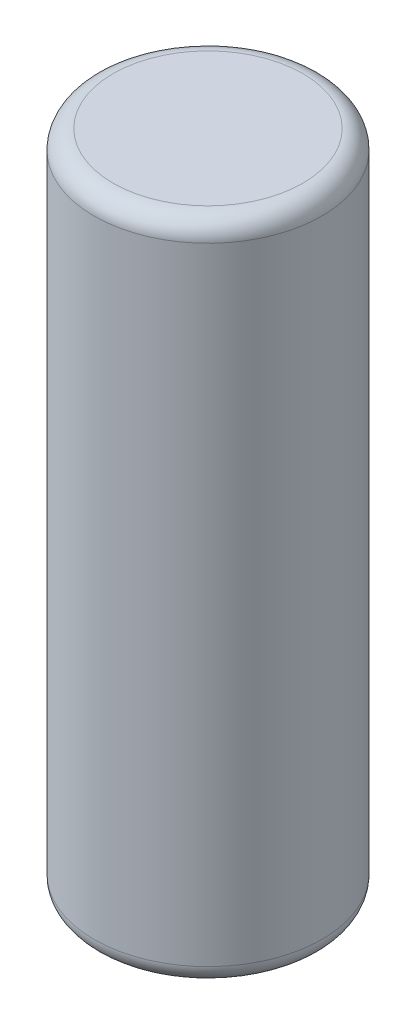
ISO-10303-21;
HEADER;
FILE_DESCRIPTION(('STEP AP214'),'2;1');
FILE_NAME('part.step','',(''),(''),'','','');
FILE_SCHEMA(('AUTOMOTIVE_DESIGN { 1 0 10303 214 1 1 1 1 }'));
ENDSEC;
DATA;
#1=APPLICATION_CONTEXT('core data for automotive mechanical design processes');
#2=APPLICATION_PROTOCOL_DEFINITION('international standard','automotive_design',2000,#1);
#3=PRODUCT_CONTEXT('',#1,'mechanical');
#4=PRODUCT('Part','Part','',(#3));
#5=PRODUCT_RELATED_PRODUCT_CATEGORY('part','',(#4));
#6=PRODUCT_DEFINITION_FORMATION('','',#4);
#7=PRODUCT_DEFINITION_CONTEXT('part definition',#1,'design');
#8=PRODUCT_DEFINITION('design','',#6,#7);
#9=PRODUCT_DEFINITION_SHAPE('','',#8);
#10=(LENGTH_UNIT() NAMED_UNIT(*) SI_UNIT(.MILLI.,.METRE.));
#11=(NAMED_UNIT(*) PLANE_ANGLE_UNIT() SI_UNIT($,.RADIAN.));
#12=(NAMED_UNIT(*) SI_UNIT($,.STERADIAN.) SOLID_ANGLE_UNIT());
#13=UNCERTAINTY_MEASURE_WITH_UNIT(LENGTH_MEASURE(1.E-05),#10,'distance_accuracy_value','');
#14=(GEOMETRIC_REPRESENTATION_CONTEXT(3) GLOBAL_UNCERTAINTY_ASSIGNED_CONTEXT((#13)) GLOBAL_UNIT_ASSIGNED_CONTEXT((#10,
#11,#12)) REPRESENTATION_CONTEXT('',''));
#15=CARTESIAN_POINT('',(0.,0.,0.));
#16=DIRECTION('',(0.,0.,1.));
#17=DIRECTION('',(1.,0.,0.));
#18=AXIS2_PLACEMENT_3D('',#15,#16,#17);
#19=CARTESIAN_POINT('',(0.,35.,0.));
#20=DIRECTION('',(0.,-1.,0.));
#21=DIRECTION('',(0.,0.,-1.));
#22=AXIS2_PLACEMENT_3D('',#19,#20,#21);
#23=CYLINDRICAL_SURFACE('',#22,6.);
#24=CARTESIAN_POINT('',(0.,1.,0.));
#25=DIRECTION('',(0.,1.,0.));
#26=DIRECTION('',(0.,0.,1.));
#27=AXIS2_PLACEMENT_3D('',#24,#25,#26);
#28=CIRCLE('',#27,6.);
#29=CARTESIAN_POINT('',(0.,1.,6.));
#30=VERTEX_POINT('',#29);
#31=EDGE_CURVE('E41',#30,#30,#28,.T.);
#32=ORIENTED_EDGE('',*,*,#31,.T.);
#33=EDGE_LOOP('',(#32));
#34=FACE_BOUND('',#33,.T.);
#35=CARTESIAN_POINT('',(0.,34.,0.));
#36=DIRECTION('',(0.,1.,0.));
#37=DIRECTION('',(0.,0.,1.));
#38=AXIS2_PLACEMENT_3D('',#35,#36,#37);
#39=CIRCLE('',#38,6.);
#40=CARTESIAN_POINT('',(0.,34.,6.));
#41=VERTEX_POINT('',#40);
#42=EDGE_CURVE('E45',#41,#41,#39,.F.);
#43=ORIENTED_EDGE('',*,*,#42,.T.);
#44=EDGE_LOOP('',(#43));
#45=FACE_BOUND('',#44,.T.);
#46=ADVANCED_FACE('F30',(#34,#45),#23,.T.);
#47=CARTESIAN_POINT('',(0.,35.,0.));
#48=DIRECTION('',(0.,1.,0.));
#49=DIRECTION('',(0.,0.,1.));
#50=AXIS2_PLACEMENT_3D('',#47,#48,#49);
#51=PLANE('',#50);
#52=CARTESIAN_POINT('',(0.,35.,0.));
#53=DIRECTION('',(0.,1.,0.));
#54=DIRECTION('',(0.,0.,1.));
#55=AXIS2_PLACEMENT_3D('',#52,#53,#54);
#56=CIRCLE('',#55,5.);
#57=CARTESIAN_POINT('',(0.,35.,5.));
#58=VERTEX_POINT('',#57);
#59=EDGE_CURVE('E10',#58,#58,#56,.T.);
#60=ORIENTED_EDGE('',*,*,#59,.T.);
#61=EDGE_LOOP('',(#60));
#62=FACE_BOUND('',#61,.T.);
#63=ADVANCED_FACE('F61',(#62),#51,.T.);
#64=CARTESIAN_POINT('',(0.,0.,0.));
#65=DIRECTION('',(0.,1.,0.));
#66=DIRECTION('',(0.,0.,1.));
#67=AXIS2_PLACEMENT_3D('',#64,#65,#66);
#68=PLANE('',#67);
#69=CARTESIAN_POINT('',(0.,0.,0.));
#70=DIRECTION('',(0.,1.,0.));
#71=DIRECTION('',(0.,0.,1.));
#72=AXIS2_PLACEMENT_3D('',#69,#70,#71);
#73=CIRCLE('',#72,5.);
#74=CARTESIAN_POINT('',(0.,0.,5.));
#75=VERTEX_POINT('',#74);
#76=EDGE_CURVE('E37',#75,#75,#73,.F.);
#77=ORIENTED_EDGE('',*,*,#76,.T.);
#78=EDGE_LOOP('',(#77));
#79=FACE_BOUND('',#78,.T.);
#80=ADVANCED_FACE('F58',(#79),#68,.F.);
#81=CARTESIAN_POINT('',(0.,1.,0.));
#82=DIRECTION('',(0.,1.,0.));
#83=DIRECTION('',(0.,0.,1.));
#84=AXIS2_PLACEMENT_3D('',#81,#82,#83);
#85=TOROIDAL_SURFACE('',#84,5.,1.);
#86=ORIENTED_EDGE('',*,*,#76,.F.);
#87=EDGE_LOOP('',(#86));
#88=FACE_BOUND('',#87,.T.);
#89=ORIENTED_EDGE('',*,*,#31,.F.);
#90=EDGE_LOOP('',(#89));
#91=FACE_BOUND('',#90,.T.);
#92=ADVANCED_FACE('F54',(#88,#91),#85,.T.);
#93=CARTESIAN_POINT('',(0.,34.,0.));
#94=DIRECTION('',(0.,1.,0.));
#95=DIRECTION('',(0.,0.,1.));
#96=AXIS2_PLACEMENT_3D('',#93,#94,#95);
#97=TOROIDAL_SURFACE('',#96,5.,1.);
#98=ORIENTED_EDGE('',*,*,#42,.F.);
#99=EDGE_LOOP('',(#98));
#100=FACE_BOUND('',#99,.T.);
#101=ORIENTED_EDGE('',*,*,#59,.F.);
#102=EDGE_LOOP('',(#101));
#103=FACE_BOUND('',#102,.T.);
#104=ADVANCED_FACE('F32',(#100,#103),#97,.T.);
#105=CLOSED_SHELL('',(#46,#63,#80,#92,#104));
#106=MANIFOLD_SOLID_BREP('B2',#105);
#107=ADVANCED_BREP_SHAPE_REPRESENTATION('',(#18,#106),#14);
#108=SHAPE_DEFINITION_REPRESENTATION(#9,#107);
ENDSEC;
END-ISO-10303-21;
